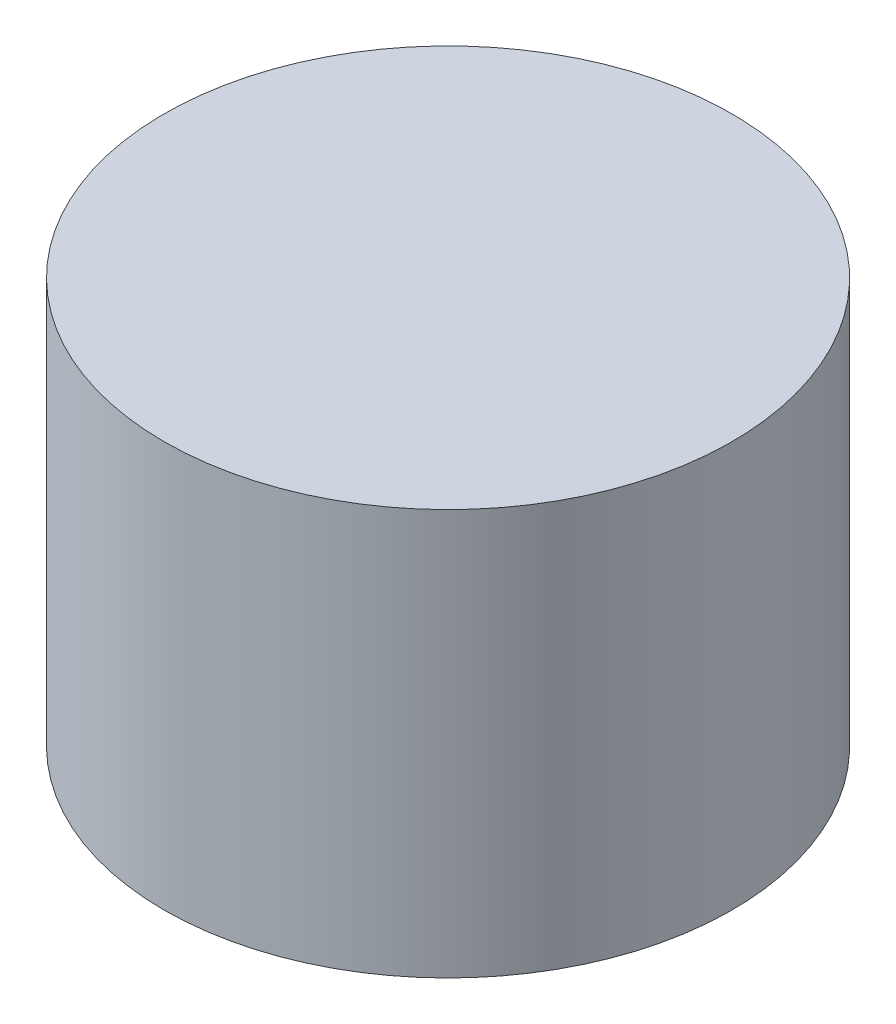
ISO-10303-21;
HEADER;
FILE_DESCRIPTION(('STEP AP214'),'2;1');
FILE_NAME('part.step','',(''),(''),'','','');
FILE_SCHEMA(('AUTOMOTIVE_DESIGN { 1 0 10303 214 1 1 1 1 }'));
ENDSEC;
DATA;
#1=APPLICATION_CONTEXT('core data for automotive mechanical design processes');
#2=APPLICATION_PROTOCOL_DEFINITION('international standard','automotive_design',2000,#1);
#3=PRODUCT_CONTEXT('',#1,'mechanical');
#4=PRODUCT('Part','Part','',(#3));
#5=PRODUCT_RELATED_PRODUCT_CATEGORY('part','',(#4));
#6=PRODUCT_DEFINITION_FORMATION('','',#4);
#7=PRODUCT_DEFINITION_CONTEXT('part definition',#1,'design');
#8=PRODUCT_DEFINITION('design','',#6,#7);
#9=PRODUCT_DEFINITION_SHAPE('','',#8);
#10=(LENGTH_UNIT() NAMED_UNIT(*) SI_UNIT(.MILLI.,.METRE.));
#11=(NAMED_UNIT(*) PLANE_ANGLE_UNIT() SI_UNIT($,.RADIAN.));
#12=(NAMED_UNIT(*) SI_UNIT($,.STERADIAN.) SOLID_ANGLE_UNIT());
#13=UNCERTAINTY_MEASURE_WITH_UNIT(LENGTH_MEASURE(1.E-05),#10,'distance_accuracy_value','');
#14=(GEOMETRIC_REPRESENTATION_CONTEXT(3) GLOBAL_UNCERTAINTY_ASSIGNED_CONTEXT((#13)) GLOBAL_UNIT_ASSIGNED_CONTEXT((#10,
#11,#12)) REPRESENTATION_CONTEXT('',''));
#15=CARTESIAN_POINT('',(0.,0.,0.));
#16=DIRECTION('',(0.,0.,1.));
#17=DIRECTION('',(1.,0.,0.));
#18=AXIS2_PLACEMENT_3D('',#15,#16,#17);
#19=CARTESIAN_POINT('',(0.,2.,0.));
#20=DIRECTION('',(0.,-1.,0.));
#21=DIRECTION('',(0.,0.,-1.));
#22=AXIS2_PLACEMENT_3D('',#19,#20,#21);
#23=CYLINDRICAL_SURFACE('',#22,1.4);
#24=CARTESIAN_POINT('',(0.,2.,0.));
#25=DIRECTION('',(0.,1.,0.));
#26=DIRECTION('',(0.,0.,1.));
#27=AXIS2_PLACEMENT_3D('',#24,#25,#26);
#28=CIRCLE('',#27,1.4);
#29=CARTESIAN_POINT('',(0.,2.,1.4));
#30=VERTEX_POINT('',#29);
#31=EDGE_CURVE('E10',#30,#30,#28,.T.);
#32=ORIENTED_EDGE('',*,*,#31,.F.);
#33=EDGE_LOOP('',(#32));
#34=FACE_BOUND('',#33,.T.);
#35=CARTESIAN_POINT('',(0.,0.,0.));
#36=DIRECTION('',(0.,1.,0.));
#37=DIRECTION('',(0.,0.,1.));
#38=AXIS2_PLACEMENT_3D('',#35,#36,#37);
#39=CIRCLE('',#38,1.4);
#40=CARTESIAN_POINT('',(0.,0.,1.4));
#41=VERTEX_POINT('',#40);
#42=EDGE_CURVE('E46',#41,#41,#39,.T.);
#43=ORIENTED_EDGE('',*,*,#42,.T.);
#44=EDGE_LOOP('',(#43));
#45=FACE_BOUND('',#44,.T.);
#46=ADVANCED_FACE('F43',(#34,#45),#23,.T.);
#47=CARTESIAN_POINT('',(0.,2.,0.));
#48=DIRECTION('',(0.,1.,0.));
#49=DIRECTION('',(0.,0.,1.));
#50=AXIS2_PLACEMENT_3D('',#47,#48,#49);
#51=PLANE('',#50);
#52=ORIENTED_EDGE('',*,*,#31,.T.);
#53=EDGE_LOOP('',(#52));
#54=FACE_BOUND('',#53,.T.);
#55=ADVANCED_FACE('F60',(#54),#51,.T.);
#56=CARTESIAN_POINT('',(0.,0.,0.));
#57=DIRECTION('',(0.,1.,0.));
#58=DIRECTION('',(0.,0.,1.));
#59=AXIS2_PLACEMENT_3D('',#56,#57,#58);
#60=PLANE('',#59);
#61=ORIENTED_EDGE('',*,*,#42,.F.);
#62=EDGE_LOOP('',(#61));
#63=FACE_BOUND('',#62,.T.);
#64=ADVANCED_FACE('F58',(#63),#60,.F.);
#65=CLOSED_SHELL('',(#46,#55,#64));
#66=MANIFOLD_SOLID_BREP('B2',#65);
#67=ADVANCED_BREP_SHAPE_REPRESENTATION('',(#18,#66),#14);
#68=SHAPE_DEFINITION_REPRESENTATION(#9,#67);
ENDSEC;
END-ISO-10303-21;
